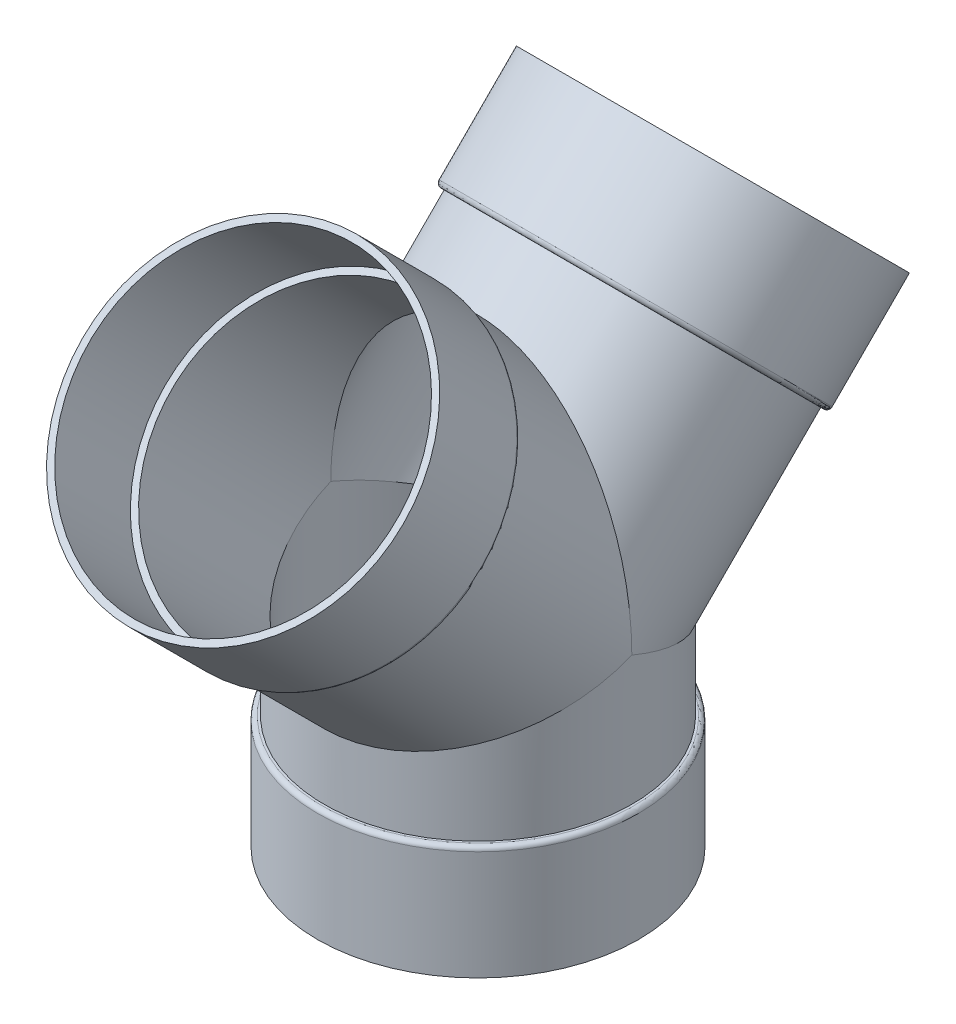
ISO-10303-21;
HEADER;
FILE_DESCRIPTION(('STEP AP214'),'2;1');
FILE_NAME('part.step','',(''),(''),'','','');
FILE_SCHEMA(('AUTOMOTIVE_DESIGN { 1 0 10303 214 1 1 1 1 }'));
ENDSEC;
DATA;
#1=APPLICATION_CONTEXT('core data for automotive mechanical design processes');
#2=APPLICATION_PROTOCOL_DEFINITION('international standard','automotive_design',2000,#1);
#3=PRODUCT_CONTEXT('',#1,'mechanical');
#4=PRODUCT('Part','Part','',(#3));
#5=PRODUCT_RELATED_PRODUCT_CATEGORY('part','',(#4));
#6=PRODUCT_DEFINITION_FORMATION('','',#4);
#7=PRODUCT_DEFINITION_CONTEXT('part definition',#1,'design');
#8=PRODUCT_DEFINITION('design','',#6,#7);
#9=PRODUCT_DEFINITION_SHAPE('','',#8);
#10=(LENGTH_UNIT() NAMED_UNIT(*) SI_UNIT(.MILLI.,.METRE.));
#11=(NAMED_UNIT(*) PLANE_ANGLE_UNIT() SI_UNIT($,.RADIAN.));
#12=(NAMED_UNIT(*) SI_UNIT($,.STERADIAN.) SOLID_ANGLE_UNIT());
#13=UNCERTAINTY_MEASURE_WITH_UNIT(LENGTH_MEASURE(1.E-05),#10,'distance_accuracy_value','');
#14=(GEOMETRIC_REPRESENTATION_CONTEXT(3) GLOBAL_UNCERTAINTY_ASSIGNED_CONTEXT((#13)) GLOBAL_UNIT_ASSIGNED_CONTEXT((#10,
#11,#12)) REPRESENTATION_CONTEXT('',''));
#15=CARTESIAN_POINT('',(0.,0.,0.));
#16=DIRECTION('',(0.,0.,1.));
#17=DIRECTION('',(1.,0.,0.));
#18=AXIS2_PLACEMENT_3D('',#15,#16,#17);
#19=CARTESIAN_POINT('',(0.,-52.1137931034483,0.));
#20=DIRECTION('',(0.,-1.,0.));
#21=DIRECTION('',(0.,0.,-1.));
#22=AXIS2_PLACEMENT_3D('',#19,#20,#21);
#23=CYLINDRICAL_SURFACE('',#22,109.5375);
#24=CARTESIAN_POINT('',(0.,80.9625,0.));
#25=DIRECTION('',(0.,-1.,0.));
#26=DIRECTION('',(0.,0.,-1.));
#27=AXIS2_PLACEMENT_3D('',#24,#25,#26);
#28=CIRCLE('',#27,109.5375);
#29=CARTESIAN_POINT('',(0.,80.9625,-109.5375));
#30=VERTEX_POINT('',#29);
#31=EDGE_CURVE('E138',#30,#30,#28,.T.);
#32=ORIENTED_EDGE('',*,*,#31,.F.);
#33=EDGE_LOOP('',(#32));
#34=FACE_BOUND('',#33,.T.);
#35=CARTESIAN_POINT('',(0.,173.0375,0.));
#36=DIRECTION('',(0.,0.923879532511287,-0.382683432365091));
#37=DIRECTION('',(0.,-0.382683432365091,-0.923879532511287));
#38=AXIS2_PLACEMENT_3D('',#35,#36,#37);
#39=ELLIPSE('',#38,118.562535639528,109.5375);
#40=CARTESIAN_POINT('',(109.5375,173.0375,0.));
#41=VERTEX_POINT('',#40);
#42=CARTESIAN_POINT('',(-109.5375,173.0375,0.));
#43=VERTEX_POINT('',#42);
#44=EDGE_CURVE('E58',#41,#43,#39,.T.);
#45=ORIENTED_EDGE('',*,*,#44,.F.);
#46=CARTESIAN_POINT('',(0.,173.0375,0.));
#47=DIRECTION('',(0.,0.923879532511286,0.382683432365091));
#48=DIRECTION('',(0.,-0.382683432365091,0.923879532511287));
#49=AXIS2_PLACEMENT_3D('',#46,#47,#48);
#50=ELLIPSE('',#49,118.562535639528,109.5375);
#51=EDGE_CURVE('E144',#43,#41,#50,.T.);
#52=ORIENTED_EDGE('',*,*,#51,.F.);
#53=EDGE_LOOP('',(#45,#52));
#54=FACE_BOUND('',#53,.T.);
#55=ADVANCED_FACE('F40',(#34,#54),#23,.T.);
#56=CARTESIAN_POINT('',(0.,80.9625,114.3));
#57=DIRECTION('',(0.,-1.,0.));
#58=DIRECTION('',(0.,0.,-1.));
#59=AXIS2_PLACEMENT_3D('',#56,#57,#58);
#60=PLANE('',#59);
#61=CARTESIAN_POINT('',(0.,80.9625,0.));
#62=DIRECTION('',(0.,-1.,0.));
#63=DIRECTION('',(0.,0.,-1.));
#64=AXIS2_PLACEMENT_3D('',#61,#62,#63);
#65=CIRCLE('',#64,111.125);
#66=CARTESIAN_POINT('',(0.,80.9625,-111.125));
#67=VERTEX_POINT('',#66);
#68=EDGE_CURVE('E154',#67,#67,#65,.F.);
#69=ORIENTED_EDGE('',*,*,#68,.T.);
#70=EDGE_LOOP('',(#69));
#71=FACE_BOUND('',#70,.T.);
#72=ORIENTED_EDGE('',*,*,#31,.T.);
#73=EDGE_LOOP('',(#72));
#74=FACE_BOUND('',#73,.T.);
#75=ADVANCED_FACE('F183',(#71,#74),#60,.F.);
#76=CARTESIAN_POINT('',(0.,-52.1137931034483,0.));
#77=DIRECTION('',(0.,-1.,0.));
#78=DIRECTION('',(0.,0.,-1.));
#79=AXIS2_PLACEMENT_3D('',#76,#77,#78);
#80=CYLINDRICAL_SURFACE('',#79,114.3);
#81=CARTESIAN_POINT('',(0.,77.7875,0.));
#82=DIRECTION('',(0.,-1.,0.));
#83=DIRECTION('',(0.,0.,-1.));
#84=AXIS2_PLACEMENT_3D('',#81,#82,#83);
#85=CIRCLE('',#84,114.3);
#86=CARTESIAN_POINT('',(0.,77.7875,-114.3));
#87=VERTEX_POINT('',#86);
#88=EDGE_CURVE('E150',#87,#87,#85,.T.);
#89=ORIENTED_EDGE('',*,*,#88,.T.);
#90=EDGE_LOOP('',(#89));
#91=FACE_BOUND('',#90,.T.);
#92=CARTESIAN_POINT('',(0.,0.,0.));
#93=DIRECTION('',(0.,-1.,0.));
#94=DIRECTION('',(0.,0.,-1.));
#95=AXIS2_PLACEMENT_3D('',#92,#93,#94);
#96=CIRCLE('',#95,114.3);
#97=CARTESIAN_POINT('',(0.,0.,-114.3));
#98=VERTEX_POINT('',#97);
#99=EDGE_CURVE('E134',#98,#98,#96,.T.);
#100=ORIENTED_EDGE('',*,*,#99,.F.);
#101=EDGE_LOOP('',(#100));
#102=FACE_BOUND('',#101,.T.);
#103=ADVANCED_FACE('F190',(#91,#102),#80,.T.);
#104=CARTESIAN_POINT('',(0.,0.,114.3));
#105=DIRECTION('',(0.,1.,0.));
#106=DIRECTION('',(0.,0.,1.));
#107=AXIS2_PLACEMENT_3D('',#104,#105,#106);
#108=PLANE('',#107);
#109=CARTESIAN_POINT('',(0.,0.,0.));
#110=DIRECTION('',(0.,1.,0.));
#111=DIRECTION('',(0.,0.,1.));
#112=AXIS2_PLACEMENT_3D('',#109,#110,#111);
#113=CIRCLE('',#112,109.5375);
#114=CARTESIAN_POINT('',(0.,0.,109.5375));
#115=VERTEX_POINT('',#114);
#116=EDGE_CURVE('E113',#115,#115,#113,.F.);
#117=ORIENTED_EDGE('',*,*,#116,.F.);
#118=EDGE_LOOP('',(#117));
#119=FACE_BOUND('',#118,.T.);
#120=ORIENTED_EDGE('',*,*,#99,.T.);
#121=EDGE_LOOP('',(#120));
#122=FACE_BOUND('',#121,.T.);
#123=ADVANCED_FACE('F211',(#119,#122),#108,.F.);
#124=CARTESIAN_POINT('',(0.,259.47246516529,-248.079575344536));
#125=DIRECTION('',(0.,0.707106781186547,-0.707106781186548));
#126=DIRECTION('',(0.,0.707106781186548,0.707106781186547));
#127=AXIS2_PLACEMENT_3D('',#124,#125,#126);
#128=PLANE('',#127);
#129=CARTESIAN_POINT('',(0.,340.294770254913,-167.257270254913));
#130=DIRECTION('',(0.,0.707106781186547,-0.707106781186548));
#131=DIRECTION('',(0.,0.707106781186548,0.707106781186547));
#132=AXIS2_PLACEMENT_3D('',#129,#130,#131);
#133=CIRCLE('',#132,109.5375);
#134=CARTESIAN_POINT('',(0.,417.749479299134,-89.8025612106919));
#135=VERTEX_POINT('',#134);
#136=EDGE_CURVE('E104',#135,#135,#133,.F.);
#137=ORIENTED_EDGE('',*,*,#136,.T.);
#138=EDGE_LOOP('',(#137));
#139=FACE_BOUND('',#138,.T.);
#140=CARTESIAN_POINT('',(0.,340.294770254913,-167.257270254913));
#141=DIRECTION('',(0.,-0.707106781186547,0.707106781186548));
#142=DIRECTION('',(0.,-0.707106781186548,-0.707106781186547));
#143=AXIS2_PLACEMENT_3D('',#140,#141,#142);
#144=CIRCLE('',#143,114.3);
#145=CARTESIAN_POINT('',(0.,259.47246516529,-248.079575344536));
#146=VERTEX_POINT('',#145);
#147=EDGE_CURVE('E130',#146,#146,#144,.T.);
#148=ORIENTED_EDGE('',*,*,#147,.F.);
#149=EDGE_LOOP('',(#148));
#150=FACE_BOUND('',#149,.T.);
#151=ADVANCED_FACE('F215',(#139,#150),#128,.T.);
#152=CARTESIAN_POINT('',(0.,340.294770254913,-167.257270254913));
#153=DIRECTION('',(0.,-0.707106781186547,0.707106781186548));
#154=DIRECTION('',(0.,-0.707106781186548,-0.707106781186547));
#155=AXIS2_PLACEMENT_3D('',#152,#153,#154);
#156=CYLINDRICAL_SURFACE('',#155,114.3);
#157=CARTESIAN_POINT('',(0.,285.290701513364,-112.253201513365));
#158=DIRECTION('',(0.,-0.707106781186547,0.707106781186548));
#159=DIRECTION('',(0.,-0.707106781186548,-0.707106781186547));
#160=AXIS2_PLACEMENT_3D('',#157,#158,#159);
#161=CIRCLE('',#160,114.3);
#162=CARTESIAN_POINT('',(0.,204.468396423742,-193.075506602987));
#163=VERTEX_POINT('',#162);
#164=EDGE_CURVE('E162',#163,#163,#161,.F.);
#165=ORIENTED_EDGE('',*,*,#164,.T.);
#166=EDGE_LOOP('',(#165));
#167=FACE_BOUND('',#166,.T.);
#168=ORIENTED_EDGE('',*,*,#147,.T.);
#169=EDGE_LOOP('',(#168));
#170=FACE_BOUND('',#169,.T.);
#171=ADVANCED_FACE('F221',(#167,#170),#156,.T.);
#172=CARTESIAN_POINT('',(0.,205.590928438875,-187.462846527319));
#173=DIRECTION('',(0.,-0.707106781186547,0.707106781186548));
#174=DIRECTION('',(0.,-0.707106781186548,-0.707106781186547));
#175=AXIS2_PLACEMENT_3D('',#172,#173,#174);
#176=PLANE('',#175);
#177=CARTESIAN_POINT('',(0.,283.045637483097,-110.008137483097));
#178=DIRECTION('',(0.,-0.707106781186547,0.707106781186548));
#179=DIRECTION('',(0.,-0.707106781186548,-0.707106781186547));
#180=AXIS2_PLACEMENT_3D('',#177,#178,#179);
#181=CIRCLE('',#180,111.125);
#182=CARTESIAN_POINT('',(0.,204.468396423742,-188.585378542452));
#183=VERTEX_POINT('',#182);
#184=EDGE_CURVE('E158',#183,#183,#181,.T.);
#185=ORIENTED_EDGE('',*,*,#184,.T.);
#186=EDGE_LOOP('',(#185));
#187=FACE_BOUND('',#186,.T.);
#188=CARTESIAN_POINT('',(0.,283.045637483097,-110.008137483097));
#189=DIRECTION('',(0.,-0.707106781186547,0.707106781186548));
#190=DIRECTION('',(0.,-0.707106781186548,-0.707106781186547));
#191=AXIS2_PLACEMENT_3D('',#188,#189,#190);
#192=CIRCLE('',#191,109.537500000001);
#193=CARTESIAN_POINT('',(0.,205.590928438875,-187.462846527319));
#194=VERTEX_POINT('',#193);
#195=EDGE_CURVE('E126',#194,#194,#192,.T.);
#196=ORIENTED_EDGE('',*,*,#195,.F.);
#197=EDGE_LOOP('',(#196));
#198=FACE_BOUND('',#197,.T.);
#199=ADVANCED_FACE('F228',(#187,#198),#176,.T.);
#200=CARTESIAN_POINT('',(0.,340.294770254913,-167.257270254913));
#201=DIRECTION('',(0.,-0.707106781186547,0.707106781186548));
#202=DIRECTION('',(0.,-0.707106781186548,-0.707106781186547));
#203=AXIS2_PLACEMENT_3D('',#200,#201,#202);
#204=CYLINDRICAL_SURFACE('',#203,109.5375);
#205=CARTESIAN_POINT('',(0.,173.0375,0.));
#206=DIRECTION('',(0.,0.,1.));
#207=DIRECTION('',(0.,-1.,0.));
#208=AXIS2_PLACEMENT_3D('',#205,#206,#207);
#209=ELLIPSE('',#208,154.909418088443,109.5375);
#210=EDGE_CURVE('E55',#41,#43,#209,.T.);
#211=ORIENTED_EDGE('',*,*,#210,.F.);
#212=ORIENTED_EDGE('',*,*,#44,.T.);
#213=EDGE_LOOP('',(#211,#212));
#214=FACE_BOUND('',#213,.T.);
#215=ORIENTED_EDGE('',*,*,#195,.T.);
#216=EDGE_LOOP('',(#215));
#217=FACE_BOUND('',#216,.T.);
#218=ADVANCED_FACE('F232',(#214,#217),#204,.T.);
#219=CARTESIAN_POINT('',(0.,259.47246516529,248.079575344536));
#220=DIRECTION('',(0.,0.707106781186547,0.707106781186548));
#221=DIRECTION('',(0.,0.707106781186548,-0.707106781186547));
#222=AXIS2_PLACEMENT_3D('',#219,#220,#221);
#223=PLANE('',#222);
#224=CARTESIAN_POINT('',(0.,340.294770254913,167.257270254913));
#225=DIRECTION('',(0.,0.707106781186547,0.707106781186548));
#226=DIRECTION('',(0.,-0.707106781186548,0.707106781186547));
#227=AXIS2_PLACEMENT_3D('',#224,#225,#226);
#228=CIRCLE('',#227,109.5375);
#229=CARTESIAN_POINT('',(0.,262.840061210691,244.711979299135));
#230=VERTEX_POINT('',#229);
#231=EDGE_CURVE('E100',#230,#230,#228,.T.);
#232=ORIENTED_EDGE('',*,*,#231,.F.);
#233=EDGE_LOOP('',(#232));
#234=FACE_BOUND('',#233,.T.);
#235=CARTESIAN_POINT('',(0.,340.294770254913,167.257270254913));
#236=DIRECTION('',(0.,0.707106781186547,0.707106781186548));
#237=DIRECTION('',(0.,-0.707106781186548,0.707106781186547));
#238=AXIS2_PLACEMENT_3D('',#235,#236,#237);
#239=CIRCLE('',#238,114.3);
#240=CARTESIAN_POINT('',(0.,259.47246516529,248.079575344536));
#241=VERTEX_POINT('',#240);
#242=EDGE_CURVE('E90',#241,#241,#239,.T.);
#243=ORIENTED_EDGE('',*,*,#242,.T.);
#244=EDGE_LOOP('',(#243));
#245=FACE_BOUND('',#244,.T.);
#246=ADVANCED_FACE('F236',(#234,#245),#223,.T.);
#247=CARTESIAN_POINT('',(0.,340.294770254913,167.257270254913));
#248=DIRECTION('',(0.,-0.707106781186547,-0.707106781186548));
#249=DIRECTION('',(0.,-0.707106781186548,0.707106781186547));
#250=AXIS2_PLACEMENT_3D('',#247,#248,#249);
#251=CYLINDRICAL_SURFACE('',#250,114.3);
#252=CARTESIAN_POINT('',(0.,285.290701513364,112.253201513365));
#253=DIRECTION('',(0.,-0.707106781186547,-0.707106781186548));
#254=DIRECTION('',(0.,0.707106781186548,-0.707106781186547));
#255=AXIS2_PLACEMENT_3D('',#252,#253,#254);
#256=CIRCLE('',#255,114.3);
#257=CARTESIAN_POINT('',(0.,366.113006602987,31.4308964237424));
#258=VERTEX_POINT('',#257);
#259=EDGE_CURVE('E49',#258,#258,#256,.F.);
#260=ORIENTED_EDGE('',*,*,#259,.T.);
#261=EDGE_LOOP('',(#260));
#262=FACE_BOUND('',#261,.T.);
#263=ORIENTED_EDGE('',*,*,#242,.F.);
#264=EDGE_LOOP('',(#263));
#265=FACE_BOUND('',#264,.T.);
#266=ADVANCED_FACE('F170',(#262,#265),#251,.T.);
#267=CARTESIAN_POINT('',(0.,205.590928438875,187.462846527319));
#268=DIRECTION('',(0.,-0.707106781186547,-0.707106781186548));
#269=DIRECTION('',(0.,-0.707106781186548,0.707106781186547));
#270=AXIS2_PLACEMENT_3D('',#267,#268,#269);
#271=PLANE('',#270);
#272=CARTESIAN_POINT('',(0.,283.045637483097,110.008137483097));
#273=DIRECTION('',(0.,-0.707106781186547,-0.707106781186548));
#274=DIRECTION('',(0.,0.707106781186548,-0.707106781186547));
#275=AXIS2_PLACEMENT_3D('',#272,#273,#274);
#276=CIRCLE('',#275,111.125);
#277=CARTESIAN_POINT('',(0.,361.622878542452,31.4308964237424));
#278=VERTEX_POINT('',#277);
#279=EDGE_CURVE('E11',#278,#278,#276,.T.);
#280=ORIENTED_EDGE('',*,*,#279,.T.);
#281=EDGE_LOOP('',(#280));
#282=FACE_BOUND('',#281,.T.);
#283=CARTESIAN_POINT('',(0.,283.045637483097,110.008137483097));
#284=DIRECTION('',(0.,0.707106781186547,0.707106781186548));
#285=DIRECTION('',(0.,-0.707106781186548,0.707106781186547));
#286=AXIS2_PLACEMENT_3D('',#283,#284,#285);
#287=CIRCLE('',#286,109.537500000001);
#288=CARTESIAN_POINT('',(0.,205.590928438875,187.462846527319));
#289=VERTEX_POINT('',#288);
#290=EDGE_CURVE('E85',#289,#289,#287,.T.);
#291=ORIENTED_EDGE('',*,*,#290,.T.);
#292=EDGE_LOOP('',(#291));
#293=FACE_BOUND('',#292,.T.);
#294=ADVANCED_FACE('F242',(#282,#293),#271,.T.);
#295=CARTESIAN_POINT('',(0.,340.294770254913,167.257270254913));
#296=DIRECTION('',(0.,-0.707106781186547,-0.707106781186548));
#297=DIRECTION('',(0.,-0.707106781186548,0.707106781186547));
#298=AXIS2_PLACEMENT_3D('',#295,#296,#297);
#299=CYLINDRICAL_SURFACE('',#298,109.5375);
#300=ORIENTED_EDGE('',*,*,#290,.F.);
#301=EDGE_LOOP('',(#300));
#302=FACE_BOUND('',#301,.T.);
#303=ORIENTED_EDGE('',*,*,#210,.T.);
#304=ORIENTED_EDGE('',*,*,#51,.T.);
#305=EDGE_LOOP('',(#303,#304));
#306=FACE_BOUND('',#305,.T.);
#307=ADVANCED_FACE('F245',(#302,#306),#299,.T.);
#308=CARTESIAN_POINT('',(0.,-52.1137931034483,0.));
#309=DIRECTION('',(0.,-1.,0.));
#310=DIRECTION('',(0.,0.,-1.));
#311=AXIS2_PLACEMENT_3D('',#308,#309,#310);
#312=CYLINDRICAL_SURFACE('',#311,104.775);
#313=CARTESIAN_POINT('',(0.,76.2,0.));
#314=DIRECTION('',(0.,-1.,0.));
#315=DIRECTION('',(0.,0.,-1.));
#316=AXIS2_PLACEMENT_3D('',#313,#314,#315);
#317=CIRCLE('',#316,104.775);
#318=CARTESIAN_POINT('',(0.,76.2,-104.775));
#319=VERTEX_POINT('',#318);
#320=EDGE_CURVE('E75',#319,#319,#317,.T.);
#321=ORIENTED_EDGE('',*,*,#320,.T.);
#322=EDGE_LOOP('',(#321));
#323=FACE_BOUND('',#322,.T.);
#324=CARTESIAN_POINT('',(0.,173.0375,0.));
#325=DIRECTION('',(0.,-0.923879532511287,0.38268343236509));
#326=DIRECTION('',(0.,0.38268343236509,0.923879532511287));
#327=AXIS2_PLACEMENT_3D('',#324,#325,#326);
#328=ELLIPSE('',#327,113.407642785636,104.775);
#329=CARTESIAN_POINT('',(104.775,173.0375,0.));
#330=VERTEX_POINT('',#329);
#331=CARTESIAN_POINT('',(-104.775,173.0375,0.));
#332=VERTEX_POINT('',#331);
#333=EDGE_CURVE('E68',#330,#332,#328,.F.);
#334=ORIENTED_EDGE('',*,*,#333,.T.);
#335=CARTESIAN_POINT('',(0.,173.0375,0.));
#336=DIRECTION('',(0.,-0.923879532511287,-0.38268343236509));
#337=DIRECTION('',(0.,0.38268343236509,-0.923879532511287));
#338=AXIS2_PLACEMENT_3D('',#335,#336,#337);
#339=ELLIPSE('',#338,113.407642785636,104.775);
#340=EDGE_CURVE('E71',#332,#330,#339,.F.);
#341=ORIENTED_EDGE('',*,*,#340,.T.);
#342=EDGE_LOOP('',(#334,#341));
#343=FACE_BOUND('',#342,.T.);
#344=ADVANCED_FACE('F70',(#323,#343),#312,.F.);
#345=CARTESIAN_POINT('',(0.,76.2,114.3));
#346=DIRECTION('',(0.,-1.,0.));
#347=DIRECTION('',(0.,0.,-1.));
#348=AXIS2_PLACEMENT_3D('',#345,#346,#347);
#349=PLANE('',#348);
#350=CARTESIAN_POINT('',(0.,76.2,0.));
#351=DIRECTION('',(0.,-1.,0.));
#352=DIRECTION('',(0.,0.,-1.));
#353=AXIS2_PLACEMENT_3D('',#350,#351,#352);
#354=CIRCLE('',#353,109.5375);
#355=CARTESIAN_POINT('',(0.,76.2,-109.5375));
#356=VERTEX_POINT('',#355);
#357=EDGE_CURVE('E94',#356,#356,#354,.T.);
#358=ORIENTED_EDGE('',*,*,#357,.T.);
#359=EDGE_LOOP('',(#358));
#360=FACE_BOUND('',#359,.T.);
#361=ORIENTED_EDGE('',*,*,#320,.F.);
#362=EDGE_LOOP('',(#361));
#363=FACE_BOUND('',#362,.T.);
#364=ADVANCED_FACE('F269',(#360,#363),#349,.T.);
#365=CARTESIAN_POINT('',(0.,-52.1137931034483,0.));
#366=DIRECTION('',(0.,-1.,0.));
#367=DIRECTION('',(0.,0.,-1.));
#368=AXIS2_PLACEMENT_3D('',#365,#366,#367);
#369=CYLINDRICAL_SURFACE('',#368,109.5375);
#370=ORIENTED_EDGE('',*,*,#116,.T.);
#371=EDGE_LOOP('',(#370));
#372=FACE_BOUND('',#371,.T.);
#373=ORIENTED_EDGE('',*,*,#357,.F.);
#374=EDGE_LOOP('',(#373));
#375=FACE_BOUND('',#374,.T.);
#376=ADVANCED_FACE('F266',(#372,#375),#369,.F.);
#377=CARTESIAN_POINT('',(0.,340.294770254913,-167.257270254913));
#378=DIRECTION('',(0.,-0.707106781186547,0.707106781186548));
#379=DIRECTION('',(0.,-0.707106781186548,-0.707106781186547));
#380=AXIS2_PLACEMENT_3D('',#377,#378,#379);
#381=CYLINDRICAL_SURFACE('',#380,109.5375);
#382=ORIENTED_EDGE('',*,*,#136,.F.);
#383=EDGE_LOOP('',(#382));
#384=FACE_BOUND('',#383,.T.);
#385=CARTESIAN_POINT('',(0.,286.413233528498,-113.375733528498));
#386=DIRECTION('',(0.,-0.707106781186547,0.707106781186548));
#387=DIRECTION('',(0.,-0.707106781186548,-0.707106781186547));
#388=AXIS2_PLACEMENT_3D('',#385,#386,#387);
#389=CIRCLE('',#388,109.5375);
#390=CARTESIAN_POINT('',(0.,208.958524484276,-190.83044257272));
#391=VERTEX_POINT('',#390);
#392=EDGE_CURVE('E99',#391,#391,#389,.T.);
#393=ORIENTED_EDGE('',*,*,#392,.T.);
#394=EDGE_LOOP('',(#393));
#395=FACE_BOUND('',#394,.T.);
#396=ADVANCED_FACE('F262',(#384,#395),#381,.F.);
#397=CARTESIAN_POINT('',(0.,208.958524484276,-190.83044257272));
#398=DIRECTION('',(0.,-0.707106781186547,0.707106781186548));
#399=DIRECTION('',(0.,-0.707106781186548,-0.707106781186547));
#400=AXIS2_PLACEMENT_3D('',#397,#398,#399);
#401=PLANE('',#400);
#402=ORIENTED_EDGE('',*,*,#392,.F.);
#403=EDGE_LOOP('',(#402));
#404=FACE_BOUND('',#403,.T.);
#405=CARTESIAN_POINT('',(0.,286.413233528498,-113.375733528498));
#406=DIRECTION('',(0.,-0.707106781186547,0.707106781186548));
#407=DIRECTION('',(0.,-0.707106781186548,-0.707106781186547));
#408=AXIS2_PLACEMENT_3D('',#405,#406,#407);
#409=CIRCLE('',#408,104.775);
#410=CARTESIAN_POINT('',(0.,212.326120529677,-187.462846527319));
#411=VERTEX_POINT('',#410);
#412=EDGE_CURVE('E95',#411,#411,#409,.T.);
#413=ORIENTED_EDGE('',*,*,#412,.T.);
#414=EDGE_LOOP('',(#413));
#415=FACE_BOUND('',#414,.T.);
#416=ADVANCED_FACE('F259',(#404,#415),#401,.F.);
#417=CARTESIAN_POINT('',(0.,340.294770254913,-167.257270254913));
#418=DIRECTION('',(0.,-0.707106781186547,0.707106781186548));
#419=DIRECTION('',(0.,-0.707106781186548,-0.707106781186547));
#420=AXIS2_PLACEMENT_3D('',#417,#418,#419);
#421=CYLINDRICAL_SURFACE('',#420,104.775);
#422=CARTESIAN_POINT('',(0.,173.0375,0.));
#423=DIRECTION('',(0.,0.,1.));
#424=DIRECTION('',(0.,-1.,0.));
#425=AXIS2_PLACEMENT_3D('',#422,#423,#424);
#426=ELLIPSE('',#425,148.174225997641,104.775);
#427=EDGE_CURVE('E79',#330,#332,#426,.T.);
#428=ORIENTED_EDGE('',*,*,#427,.T.);
#429=ORIENTED_EDGE('',*,*,#333,.F.);
#430=EDGE_LOOP('',(#428,#429));
#431=FACE_BOUND('',#430,.T.);
#432=ORIENTED_EDGE('',*,*,#412,.F.);
#433=EDGE_LOOP('',(#432));
#434=FACE_BOUND('',#433,.T.);
#435=ADVANCED_FACE('F82',(#431,#434),#421,.F.);
#436=CARTESIAN_POINT('',(0.,340.294770254913,167.257270254913));
#437=DIRECTION('',(0.,-0.707106781186547,-0.707106781186548));
#438=DIRECTION('',(0.,-0.707106781186548,0.707106781186547));
#439=AXIS2_PLACEMENT_3D('',#436,#437,#438);
#440=CYLINDRICAL_SURFACE('',#439,109.5375);
#441=ORIENTED_EDGE('',*,*,#231,.T.);
#442=EDGE_LOOP('',(#441));
#443=FACE_BOUND('',#442,.T.);
#444=CARTESIAN_POINT('',(0.,286.413233528498,113.375733528498));
#445=DIRECTION('',(0.,-0.707106781186547,-0.707106781186548));
#446=DIRECTION('',(0.,0.707106781186548,-0.707106781186547));
#447=AXIS2_PLACEMENT_3D('',#444,#445,#446);
#448=CIRCLE('',#447,109.5375);
#449=CARTESIAN_POINT('',(0.,363.867942572719,35.921024484277));
#450=VERTEX_POINT('',#449);
#451=EDGE_CURVE('E109',#450,#450,#448,.F.);
#452=ORIENTED_EDGE('',*,*,#451,.F.);
#453=EDGE_LOOP('',(#452));
#454=FACE_BOUND('',#453,.T.);
#455=ADVANCED_FACE('F252',(#443,#454),#440,.F.);
#456=CARTESIAN_POINT('',(0.,208.958524484276,190.83044257272));
#457=DIRECTION('',(0.,-0.707106781186547,-0.707106781186548));
#458=DIRECTION('',(0.,-0.707106781186548,0.707106781186547));
#459=AXIS2_PLACEMENT_3D('',#456,#457,#458);
#460=PLANE('',#459);
#461=ORIENTED_EDGE('',*,*,#451,.T.);
#462=EDGE_LOOP('',(#461));
#463=FACE_BOUND('',#462,.T.);
#464=CARTESIAN_POINT('',(0.,286.413233528498,113.375733528498));
#465=DIRECTION('',(0.,-0.707106781186547,-0.707106781186548));
#466=DIRECTION('',(0.,0.707106781186548,-0.707106781186547));
#467=AXIS2_PLACEMENT_3D('',#464,#465,#466);
#468=CIRCLE('',#467,104.775);
#469=CARTESIAN_POINT('',(0.,360.500346527319,39.2886205296776));
#470=VERTEX_POINT('',#469);
#471=EDGE_CURVE('E105',#470,#470,#468,.F.);
#472=ORIENTED_EDGE('',*,*,#471,.F.);
#473=EDGE_LOOP('',(#472));
#474=FACE_BOUND('',#473,.T.);
#475=ADVANCED_FACE('F203',(#463,#474),#460,.F.);
#476=CARTESIAN_POINT('',(0.,340.294770254913,167.257270254913));
#477=DIRECTION('',(0.,-0.707106781186547,-0.707106781186548));
#478=DIRECTION('',(0.,-0.707106781186548,0.707106781186547));
#479=AXIS2_PLACEMENT_3D('',#476,#477,#478);
#480=CYLINDRICAL_SURFACE('',#479,104.775);
#481=ORIENTED_EDGE('',*,*,#471,.T.);
#482=EDGE_LOOP('',(#481));
#483=FACE_BOUND('',#482,.T.);
#484=ORIENTED_EDGE('',*,*,#427,.F.);
#485=ORIENTED_EDGE('',*,*,#340,.F.);
#486=EDGE_LOOP('',(#484,#485));
#487=FACE_BOUND('',#486,.T.);
#488=ADVANCED_FACE('F78',(#483,#487),#480,.F.);
#489=CARTESIAN_POINT('',(0.,77.7875,0.));
#490=DIRECTION('',(0.,-1.,0.));
#491=DIRECTION('',(0.,0.,-1.));
#492=AXIS2_PLACEMENT_3D('',#489,#490,#491);
#493=TOROIDAL_SURFACE('',#492,111.125,3.175);
#494=ORIENTED_EDGE('',*,*,#68,.F.);
#495=EDGE_LOOP('',(#494));
#496=FACE_BOUND('',#495,.T.);
#497=ORIENTED_EDGE('',*,*,#88,.F.);
#498=EDGE_LOOP('',(#497));
#499=FACE_BOUND('',#498,.T.);
#500=ADVANCED_FACE('F179',(#496,#499),#493,.T.);
#501=CARTESIAN_POINT('',(0.,285.290701513364,-112.253201513365));
#502=DIRECTION('',(0.,-0.707106781186547,0.707106781186548));
#503=DIRECTION('',(0.,-0.707106781186548,-0.707106781186547));
#504=AXIS2_PLACEMENT_3D('',#501,#502,#503);
#505=TOROIDAL_SURFACE('',#504,111.125,3.175);
#506=ORIENTED_EDGE('',*,*,#164,.F.);
#507=EDGE_LOOP('',(#506));
#508=FACE_BOUND('',#507,.T.);
#509=ORIENTED_EDGE('',*,*,#184,.F.);
#510=EDGE_LOOP('',(#509));
#511=FACE_BOUND('',#510,.T.);
#512=ADVANCED_FACE('F174',(#508,#511),#505,.T.);
#513=CARTESIAN_POINT('',(0.,285.290701513364,112.253201513365));
#514=DIRECTION('',(0.,-0.707106781186547,-0.707106781186548));
#515=DIRECTION('',(0.,0.707106781186548,-0.707106781186547));
#516=AXIS2_PLACEMENT_3D('',#513,#514,#515);
#517=TOROIDAL_SURFACE('',#516,111.125,3.175);
#518=ORIENTED_EDGE('',*,*,#279,.F.);
#519=EDGE_LOOP('',(#518));
#520=FACE_BOUND('',#519,.T.);
#521=ORIENTED_EDGE('',*,*,#259,.F.);
#522=EDGE_LOOP('',(#521));
#523=FACE_BOUND('',#522,.T.);
#524=ADVANCED_FACE('F42',(#520,#523),#517,.T.);
#525=CLOSED_SHELL('',(#55,#75,#103,#123,#151,#171,#199,#218,#246,#266,#294,#307,#344,#364,#376,
#396,#416,#435,#455,#475,#488,#500,#512,#524));
#526=MANIFOLD_SOLID_BREP('B2',#525);
#527=ADVANCED_BREP_SHAPE_REPRESENTATION('',(#18,#526),#14);
#528=SHAPE_DEFINITION_REPRESENTATION(#9,#527);
ENDSEC;
END-ISO-10303-21;
